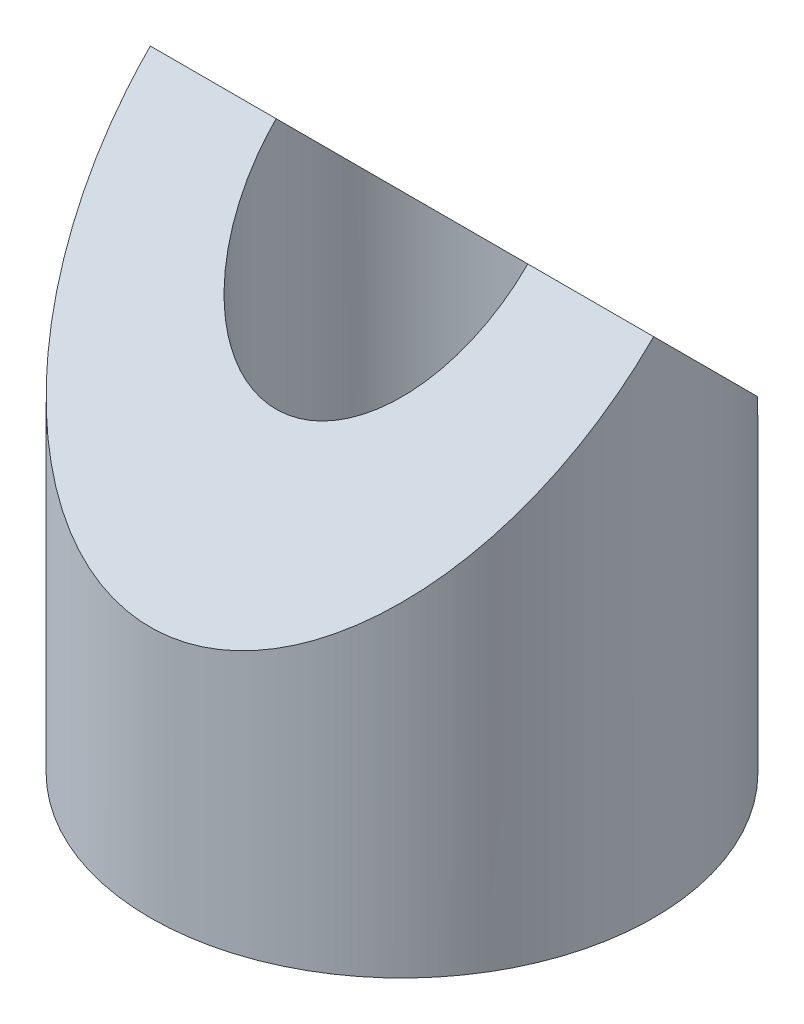
ISO-10303-21;
HEADER;
FILE_DESCRIPTION(('STEP AP214'),'2;1');
FILE_NAME('part.step','',(''),(''),'','','');
FILE_SCHEMA(('AUTOMOTIVE_DESIGN { 1 0 10303 214 1 1 1 1 }'));
ENDSEC;
DATA;
#1=APPLICATION_CONTEXT('core data for automotive mechanical design processes');
#2=APPLICATION_PROTOCOL_DEFINITION('international standard','automotive_design',2000,#1);
#3=PRODUCT_CONTEXT('',#1,'mechanical');
#4=PRODUCT('Part','Part','',(#3));
#5=PRODUCT_RELATED_PRODUCT_CATEGORY('part','',(#4));
#6=PRODUCT_DEFINITION_FORMATION('','',#4);
#7=PRODUCT_DEFINITION_CONTEXT('part definition',#1,'design');
#8=PRODUCT_DEFINITION('design','',#6,#7);
#9=PRODUCT_DEFINITION_SHAPE('','',#8);
#10=(LENGTH_UNIT() NAMED_UNIT(*) SI_UNIT(.MILLI.,.METRE.));
#11=(NAMED_UNIT(*) PLANE_ANGLE_UNIT() SI_UNIT($,.RADIAN.));
#12=(NAMED_UNIT(*) SI_UNIT($,.STERADIAN.) SOLID_ANGLE_UNIT());
#13=UNCERTAINTY_MEASURE_WITH_UNIT(LENGTH_MEASURE(1.E-05),#10,'distance_accuracy_value','');
#14=(GEOMETRIC_REPRESENTATION_CONTEXT(3) GLOBAL_UNCERTAINTY_ASSIGNED_CONTEXT((#13)) GLOBAL_UNIT_ASSIGNED_CONTEXT((#10,
#11,#12)) REPRESENTATION_CONTEXT('',''));
#15=CARTESIAN_POINT('',(0.,0.,0.));
#16=DIRECTION('',(0.,0.,1.));
#17=DIRECTION('',(1.,0.,0.));
#18=AXIS2_PLACEMENT_3D('',#15,#16,#17);
#19=CARTESIAN_POINT('',(0.,0.,0.));
#20=DIRECTION('',(0.,1.,0.));
#21=DIRECTION('',(0.,0.,1.));
#22=AXIS2_PLACEMENT_3D('',#19,#20,#21);
#23=PLANE('',#22);
#24=CARTESIAN_POINT('',(0.,0.,0.));
#25=DIRECTION('',(0.,1.,0.));
#26=DIRECTION('',(0.,0.,1.));
#27=AXIS2_PLACEMENT_3D('',#24,#25,#26);
#28=CIRCLE('',#27,2.);
#29=CARTESIAN_POINT('',(0.,0.,2.));
#30=VERTEX_POINT('',#29);
#31=EDGE_CURVE('E42',#30,#30,#28,.T.);
#32=ORIENTED_EDGE('',*,*,#31,.F.);
#33=EDGE_LOOP('',(#32));
#34=FACE_BOUND('',#33,.T.);
#35=CARTESIAN_POINT('',(0.,0.,0.));
#36=DIRECTION('',(0.,1.,0.));
#37=DIRECTION('',(0.,0.,1.));
#38=AXIS2_PLACEMENT_3D('',#35,#36,#37);
#39=CIRCLE('',#38,1.);
#40=CARTESIAN_POINT('',(0.,0.,1.));
#41=VERTEX_POINT('',#40);
#42=EDGE_CURVE('E72',#41,#41,#39,.T.);
#43=ORIENTED_EDGE('',*,*,#42,.T.);
#44=EDGE_LOOP('',(#43));
#45=FACE_BOUND('',#44,.T.);
#46=ADVANCED_FACE('F34',(#34,#45),#23,.F.);
#47=CARTESIAN_POINT('',(0.,4.,0.));
#48=DIRECTION('',(0.,-1.,0.));
#49=DIRECTION('',(0.,0.,-1.));
#50=AXIS2_PLACEMENT_3D('',#47,#48,#49);
#51=CYLINDRICAL_SURFACE('',#50,2.);
#52=CARTESIAN_POINT('',(0.,4.,0.));
#53=DIRECTION('',(0.,-0.707106781186547,-0.707106781186547));
#54=DIRECTION('',(0.,-0.707106781186548,0.707106781186548));
#55=AXIS2_PLACEMENT_3D('',#52,#53,#54);
#56=ELLIPSE('',#55,2.82842712474619,2.);
#57=CARTESIAN_POINT('',(2.,4.,0.));
#58=VERTEX_POINT('',#57);
#59=CARTESIAN_POINT('',(-2.,4.,0.));
#60=VERTEX_POINT('',#59);
#61=EDGE_CURVE('E49',#58,#60,#56,.T.);
#62=ORIENTED_EDGE('',*,*,#61,.T.);
#63=CARTESIAN_POINT('',(0.,4.,0.));
#64=DIRECTION('',(0.,-0.707106781186547,0.707106781186547));
#65=DIRECTION('',(0.,-0.707106781186548,-0.707106781186548));
#66=AXIS2_PLACEMENT_3D('',#63,#64,#65);
#67=ELLIPSE('',#66,2.82842712474619,2.);
#68=EDGE_CURVE('E62',#60,#58,#67,.T.);
#69=ORIENTED_EDGE('',*,*,#68,.T.);
#70=EDGE_LOOP('',(#62,#69));
#71=FACE_BOUND('',#70,.T.);
#72=ORIENTED_EDGE('',*,*,#31,.T.);
#73=EDGE_LOOP('',(#72));
#74=FACE_BOUND('',#73,.T.);
#75=ADVANCED_FACE('F36',(#71,#74),#51,.T.);
#76=CARTESIAN_POINT('',(0.,4.,0.));
#77=DIRECTION('',(0.,-1.,0.));
#78=DIRECTION('',(0.,0.,-1.));
#79=AXIS2_PLACEMENT_3D('',#76,#77,#78);
#80=CYLINDRICAL_SURFACE('',#79,1.);
#81=CARTESIAN_POINT('',(0.,4.,0.));
#82=DIRECTION('',(0.,-0.707106781186547,-0.707106781186547));
#83=DIRECTION('',(0.,-0.707106781186548,0.707106781186548));
#84=AXIS2_PLACEMENT_3D('',#81,#82,#83);
#85=ELLIPSE('',#84,1.4142135623731,1.);
#86=CARTESIAN_POINT('',(1.,4.,0.));
#87=VERTEX_POINT('',#86);
#88=CARTESIAN_POINT('',(-1.,4.,0.));
#89=VERTEX_POINT('',#88);
#90=EDGE_CURVE('E63',#87,#89,#85,.T.);
#91=ORIENTED_EDGE('',*,*,#90,.F.);
#92=CARTESIAN_POINT('',(0.,4.,0.));
#93=DIRECTION('',(0.,-0.707106781186547,0.707106781186547));
#94=DIRECTION('',(0.,-0.707106781186548,-0.707106781186548));
#95=AXIS2_PLACEMENT_3D('',#92,#93,#94);
#96=ELLIPSE('',#95,1.4142135623731,1.);
#97=EDGE_CURVE('E12',#89,#87,#96,.T.);
#98=ORIENTED_EDGE('',*,*,#97,.F.);
#99=EDGE_LOOP('',(#91,#98));
#100=FACE_BOUND('',#99,.T.);
#101=ORIENTED_EDGE('',*,*,#42,.F.);
#102=EDGE_LOOP('',(#101));
#103=FACE_BOUND('',#102,.T.);
#104=ADVANCED_FACE('F83',(#100,#103),#80,.F.);
#105=CARTESIAN_POINT('',(-2.,2.,-2.));
#106=DIRECTION('',(0.,-0.707106781186547,0.707106781186547));
#107=DIRECTION('',(0.,-0.707106781186548,-0.707106781186548));
#108=AXIS2_PLACEMENT_3D('',#105,#106,#107);
#109=PLANE('',#108);
#110=ORIENTED_EDGE('',*,*,#68,.F.);
#111=DIRECTION('',(1.,0.,0.));
#112=VECTOR('',#111,1.);
#113=CARTESIAN_POINT('',(-2.,4.,0.));
#114=LINE('',#113,#112);
#115=EDGE_CURVE('E66',#60,#89,#114,.T.);
#116=ORIENTED_EDGE('',*,*,#115,.T.);
#117=ORIENTED_EDGE('',*,*,#97,.T.);
#118=EDGE_CURVE('E54',#87,#58,#114,.T.);
#119=ORIENTED_EDGE('',*,*,#118,.T.);
#120=EDGE_LOOP('',(#110,#116,#117,#119));
#121=FACE_BOUND('',#120,.T.);
#122=ADVANCED_FACE('F71',(#121),#109,.F.);
#123=CARTESIAN_POINT('',(-2.,2.,2.));
#124=DIRECTION('',(0.,-0.707106781186547,-0.707106781186547));
#125=DIRECTION('',(0.,0.707106781186548,-0.707106781186548));
#126=AXIS2_PLACEMENT_3D('',#123,#124,#125);
#127=PLANE('',#126);
#128=ORIENTED_EDGE('',*,*,#61,.F.);
#129=ORIENTED_EDGE('',*,*,#118,.F.);
#130=ORIENTED_EDGE('',*,*,#90,.T.);
#131=ORIENTED_EDGE('',*,*,#115,.F.);
#132=EDGE_LOOP('',(#128,#129,#130,#131));
#133=FACE_BOUND('',#132,.T.);
#134=ADVANCED_FACE('F67',(#133),#127,.F.);
#135=CLOSED_SHELL('',(#46,#75,#104,#122,#134));
#136=MANIFOLD_SOLID_BREP('B2',#135);
#137=ADVANCED_BREP_SHAPE_REPRESENTATION('',(#18,#136),#14);
#138=SHAPE_DEFINITION_REPRESENTATION(#9,#137);
ENDSEC;
END-ISO-10303-21;
